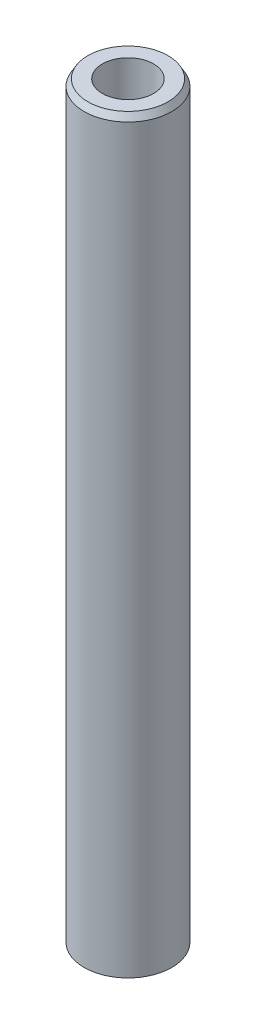
ISO-10303-21;
HEADER;
FILE_DESCRIPTION(('STEP AP214'),'2;1');
FILE_NAME('part.step','',(''),(''),'','','');
FILE_SCHEMA(('AUTOMOTIVE_DESIGN { 1 0 10303 214 1 1 1 1 }'));
ENDSEC;
DATA;
#1=APPLICATION_CONTEXT('core data for automotive mechanical design processes');
#2=APPLICATION_PROTOCOL_DEFINITION('international standard','automotive_design',2000,#1);
#3=PRODUCT_CONTEXT('',#1,'mechanical');
#4=PRODUCT('Part','Part','',(#3));
#5=PRODUCT_RELATED_PRODUCT_CATEGORY('part','',(#4));
#6=PRODUCT_DEFINITION_FORMATION('','',#4);
#7=PRODUCT_DEFINITION_CONTEXT('part definition',#1,'design');
#8=PRODUCT_DEFINITION('design','',#6,#7);
#9=PRODUCT_DEFINITION_SHAPE('','',#8);
#10=(LENGTH_UNIT() NAMED_UNIT(*) SI_UNIT(.MILLI.,.METRE.));
#11=(NAMED_UNIT(*) PLANE_ANGLE_UNIT() SI_UNIT($,.RADIAN.));
#12=(NAMED_UNIT(*) SI_UNIT($,.STERADIAN.) SOLID_ANGLE_UNIT());
#13=UNCERTAINTY_MEASURE_WITH_UNIT(LENGTH_MEASURE(1.E-05),#10,'distance_accuracy_value','');
#14=(GEOMETRIC_REPRESENTATION_CONTEXT(3) GLOBAL_UNCERTAINTY_ASSIGNED_CONTEXT((#13)) GLOBAL_UNIT_ASSIGNED_CONTEXT((#10,
#11,#12)) REPRESENTATION_CONTEXT('',''));
#15=CARTESIAN_POINT('',(0.,0.,0.));
#16=DIRECTION('',(0.,0.,1.));
#17=DIRECTION('',(1.,0.,0.));
#18=AXIS2_PLACEMENT_3D('',#15,#16,#17);
#19=CARTESIAN_POINT('',(0.,600.,0.));
#20=DIRECTION('',(0.,-1.,0.));
#21=DIRECTION('',(0.,0.,-1.));
#22=AXIS2_PLACEMENT_3D('',#19,#20,#21);
#23=CYLINDRICAL_SURFACE('',#22,35.);
#24=CARTESIAN_POINT('',(0.,594.756124398023,0.));
#25=DIRECTION('',(0.,1.,0.));
#26=DIRECTION('',(0.,0.,1.));
#27=AXIS2_PLACEMENT_3D('',#24,#25,#26);
#28=CIRCLE('',#27,35.);
#29=CARTESIAN_POINT('',(0.,594.756124398023,35.));
#30=VERTEX_POINT('',#29);
#31=EDGE_CURVE('E50',#30,#30,#28,.F.);
#32=ORIENTED_EDGE('',*,*,#31,.T.);
#33=EDGE_LOOP('',(#32));
#34=FACE_BOUND('',#33,.T.);
#35=CARTESIAN_POINT('',(0.,3.02755299039792,0.));
#36=DIRECTION('',(0.,1.,0.));
#37=DIRECTION('',(0.,0.,1.));
#38=AXIS2_PLACEMENT_3D('',#35,#36,#37);
#39=CIRCLE('',#38,35.);
#40=CARTESIAN_POINT('',(0.,3.02755299039792,35.));
#41=VERTEX_POINT('',#40);
#42=EDGE_CURVE('E51',#41,#41,#39,.T.);
#43=ORIENTED_EDGE('',*,*,#42,.T.);
#44=EDGE_LOOP('',(#43));
#45=FACE_BOUND('',#44,.T.);
#46=ADVANCED_FACE('F39',(#34,#45),#23,.T.);
#47=CARTESIAN_POINT('',(0.,600.,0.));
#48=DIRECTION('',(0.,1.,0.));
#49=DIRECTION('',(0.,0.,1.));
#50=AXIS2_PLACEMENT_3D('',#47,#48,#49);
#51=PLANE('',#50);
#52=CARTESIAN_POINT('',(0.,600.,0.));
#53=DIRECTION('',(0.,1.,0.));
#54=DIRECTION('',(0.,0.,1.));
#55=AXIS2_PLACEMENT_3D('',#52,#53,#54);
#56=CIRCLE('',#55,31.9724470096019);
#57=CARTESIAN_POINT('',(0.,600.,31.9724470096019));
#58=VERTEX_POINT('',#57);
#59=EDGE_CURVE('E54',#58,#58,#56,.T.);
#60=ORIENTED_EDGE('',*,*,#59,.T.);
#61=EDGE_LOOP('',(#60));
#62=FACE_BOUND('',#61,.T.);
#63=CARTESIAN_POINT('',(0.,600.,0.));
#64=DIRECTION('',(0.,1.,0.));
#65=DIRECTION('',(0.,0.,1.));
#66=AXIS2_PLACEMENT_3D('',#63,#64,#65);
#67=CIRCLE('',#66,20.4804745438019);
#68=CARTESIAN_POINT('',(0.,600.,20.4804745438019));
#69=VERTEX_POINT('',#68);
#70=EDGE_CURVE('E58',#69,#69,#67,.T.);
#71=ORIENTED_EDGE('',*,*,#70,.F.);
#72=EDGE_LOOP('',(#71));
#73=FACE_BOUND('',#72,.T.);
#74=ADVANCED_FACE('F69',(#62,#73),#51,.T.);
#75=CARTESIAN_POINT('',(0.,0.,0.));
#76=DIRECTION('',(0.,1.,0.));
#77=DIRECTION('',(0.,0.,1.));
#78=AXIS2_PLACEMENT_3D('',#75,#76,#77);
#79=PLANE('',#78);
#80=CARTESIAN_POINT('',(0.,0.,0.));
#81=DIRECTION('',(0.,1.,0.));
#82=DIRECTION('',(0.,0.,1.));
#83=AXIS2_PLACEMENT_3D('',#80,#81,#82);
#84=CIRCLE('',#83,29.7561243980236);
#85=CARTESIAN_POINT('',(0.,0.,29.7561243980236));
#86=VERTEX_POINT('',#85);
#87=EDGE_CURVE('E10',#86,#86,#84,.F.);
#88=ORIENTED_EDGE('',*,*,#87,.T.);
#89=EDGE_LOOP('',(#88));
#90=FACE_BOUND('',#89,.T.);
#91=CARTESIAN_POINT('',(0.,0.,0.));
#92=DIRECTION('',(0.,1.,0.));
#93=DIRECTION('',(0.,0.,1.));
#94=AXIS2_PLACEMENT_3D('',#91,#92,#93);
#95=CIRCLE('',#94,20.4804745438019);
#96=CARTESIAN_POINT('',(0.,0.,20.4804745438019));
#97=VERTEX_POINT('',#96);
#98=EDGE_CURVE('E63',#97,#97,#95,.T.);
#99=ORIENTED_EDGE('',*,*,#98,.T.);
#100=EDGE_LOOP('',(#99));
#101=FACE_BOUND('',#100,.T.);
#102=ADVANCED_FACE('F75',(#90,#101),#79,.F.);
#103=CARTESIAN_POINT('',(0.,600.,0.));
#104=DIRECTION('',(0.,-1.,0.));
#105=DIRECTION('',(0.,0.,-1.));
#106=AXIS2_PLACEMENT_3D('',#103,#104,#105);
#107=CYLINDRICAL_SURFACE('',#106,20.4804745438019);
#108=ORIENTED_EDGE('',*,*,#70,.T.);
#109=EDGE_LOOP('',(#108));
#110=FACE_BOUND('',#109,.T.);
#111=ORIENTED_EDGE('',*,*,#98,.F.);
#112=EDGE_LOOP('',(#111));
#113=FACE_BOUND('',#112,.T.);
#114=ADVANCED_FACE('F70',(#110,#113),#107,.F.);
#115=CARTESIAN_POINT('',(0.,600.,0.));
#116=DIRECTION('',(0.,-1.,0.));
#117=DIRECTION('',(0.,0.,-1.));
#118=AXIS2_PLACEMENT_3D('',#115,#116,#117);
#119=CONICAL_SURFACE('',#118,31.9724470096019,0.523598775598293);
#120=ORIENTED_EDGE('',*,*,#31,.F.);
#121=EDGE_LOOP('',(#120));
#122=FACE_BOUND('',#121,.T.);
#123=ORIENTED_EDGE('',*,*,#59,.F.);
#124=EDGE_LOOP('',(#123));
#125=FACE_BOUND('',#124,.T.);
#126=ADVANCED_FACE('F81',(#122,#125),#119,.T.);
#127=CARTESIAN_POINT('',(0.,3.02755299039792,0.));
#128=DIRECTION('',(0.,1.,0.));
#129=DIRECTION('',(0.,0.,1.));
#130=AXIS2_PLACEMENT_3D('',#127,#128,#129);
#131=CONICAL_SURFACE('',#130,35.,1.04719755119661);
#132=ORIENTED_EDGE('',*,*,#87,.F.);
#133=EDGE_LOOP('',(#132));
#134=FACE_BOUND('',#133,.T.);
#135=ORIENTED_EDGE('',*,*,#42,.F.);
#136=EDGE_LOOP('',(#135));
#137=FACE_BOUND('',#136,.T.);
#138=ADVANCED_FACE('F45',(#134,#137),#131,.T.);
#139=CLOSED_SHELL('',(#46,#74,#102,#114,#126,#138));
#140=MANIFOLD_SOLID_BREP('B2',#139);
#141=ADVANCED_BREP_SHAPE_REPRESENTATION('',(#18,#140),#14);
#142=SHAPE_DEFINITION_REPRESENTATION(#9,#141);
ENDSEC;
END-ISO-10303-21;
